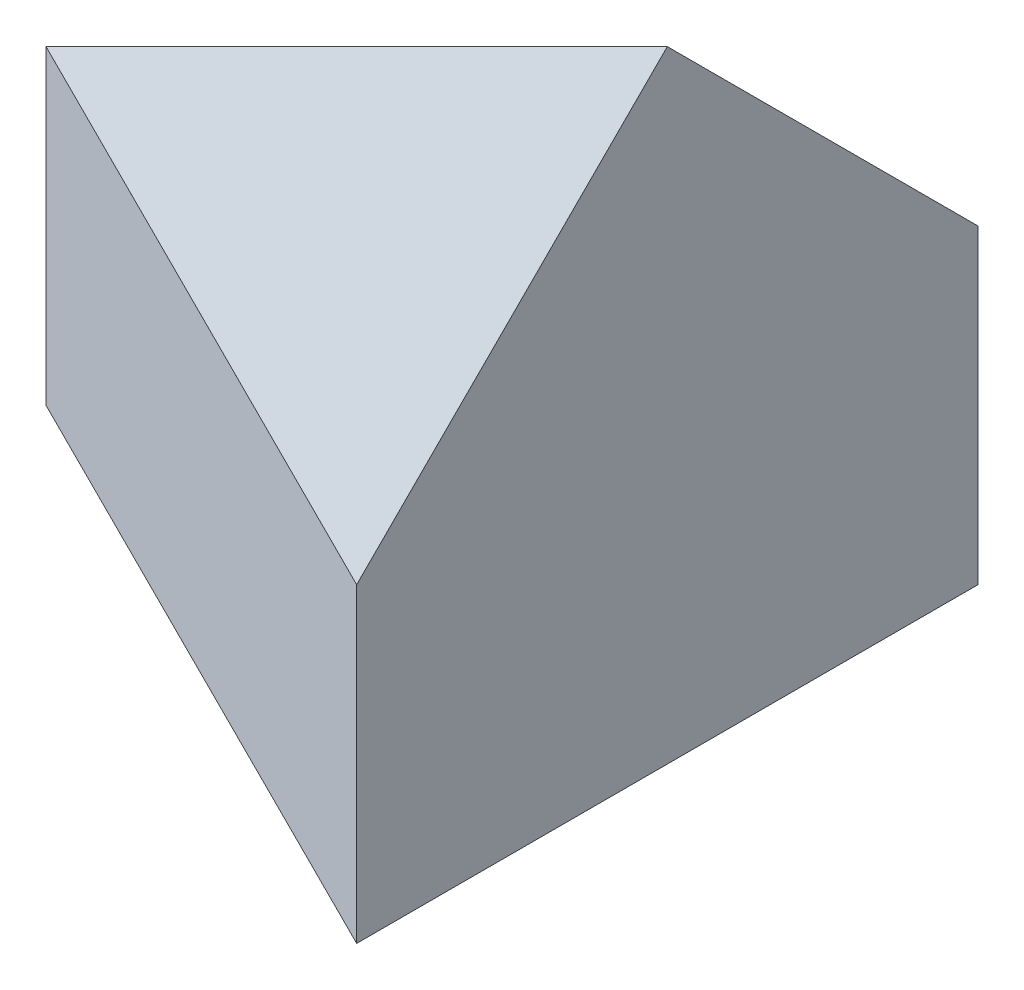
ISO-10303-21;
HEADER;
FILE_DESCRIPTION(('STEP AP214'),'2;1');
FILE_NAME('part.step','',(''),(''),'','','');
FILE_SCHEMA(('AUTOMOTIVE_DESIGN { 1 0 10303 214 1 1 1 1 }'));
ENDSEC;
DATA;
#1=APPLICATION_CONTEXT('core data for automotive mechanical design processes');
#2=APPLICATION_PROTOCOL_DEFINITION('international standard','automotive_design',2000,#1);
#3=PRODUCT_CONTEXT('',#1,'mechanical');
#4=PRODUCT('Part','Part','',(#3));
#5=PRODUCT_RELATED_PRODUCT_CATEGORY('part','',(#4));
#6=PRODUCT_DEFINITION_FORMATION('','',#4);
#7=PRODUCT_DEFINITION_CONTEXT('part definition',#1,'design');
#8=PRODUCT_DEFINITION('design','',#6,#7);
#9=PRODUCT_DEFINITION_SHAPE('','',#8);
#10=(LENGTH_UNIT() NAMED_UNIT(*) SI_UNIT(.MILLI.,.METRE.));
#11=(NAMED_UNIT(*) PLANE_ANGLE_UNIT() SI_UNIT($,.RADIAN.));
#12=(NAMED_UNIT(*) SI_UNIT($,.STERADIAN.) SOLID_ANGLE_UNIT());
#13=UNCERTAINTY_MEASURE_WITH_UNIT(LENGTH_MEASURE(1.E-05),#10,'distance_accuracy_value','');
#14=(GEOMETRIC_REPRESENTATION_CONTEXT(3) GLOBAL_UNCERTAINTY_ASSIGNED_CONTEXT((#13)) GLOBAL_UNIT_ASSIGNED_CONTEXT((#10,
#11,#12)) REPRESENTATION_CONTEXT('',''));
#15=CARTESIAN_POINT('',(0.,0.,0.));
#16=DIRECTION('',(0.,0.,1.));
#17=DIRECTION('',(1.,0.,0.));
#18=AXIS2_PLACEMENT_3D('',#15,#16,#17);
#19=CARTESIAN_POINT('',(40.,0.,40.));
#20=DIRECTION('',(-1.,0.,0.));
#21=DIRECTION('',(0.,0.,1.));
#22=AXIS2_PLACEMENT_3D('',#19,#20,#21);
#23=PLANE('',#22);
#24=DIRECTION('',(0.,-0.707090091795653,-0.707123470183542));
#25=VECTOR('',#24,1.);
#26=CARTESIAN_POINT('',(40.,30.0005499739353,10.0008661436681));
#27=LINE('',#26,#25);
#28=CARTESIAN_POINT('',(40.,40.,20.0007881966011));
#29=VERTEX_POINT('',#28);
#30=CARTESIAN_POINT('',(40.,20.0001559016994,0.));
#31=VERTEX_POINT('',#30);
#32=EDGE_CURVE('E63',#29,#31,#27,.T.);
#33=ORIENTED_EDGE('',*,*,#32,.F.);
#34=DIRECTION('',(0.,-1.,0.));
#35=VECTOR('',#34,1.);
#36=CARTESIAN_POINT('',(40.,0.,20.0007881966011));
#37=LINE('',#36,#35);
#38=CARTESIAN_POINT('',(40.,39.9998881966011,20.0007881966011));
#39=VERTEX_POINT('',#38);
#40=EDGE_CURVE('E228',#29,#39,#37,.T.);
#41=ORIENTED_EDGE('',*,*,#40,.T.);
#42=DIRECTION('',(0.,0.,1.));
#43=VECTOR('',#42,1.);
#44=CARTESIAN_POINT('',(40.,39.9998881966012,40.));
#45=LINE('',#44,#43);
#46=CARTESIAN_POINT('',(40.,39.9998881966011,20.0008881966011));
#47=VERTEX_POINT('',#46);
#48=EDGE_CURVE('E182',#39,#47,#45,.T.);
#49=ORIENTED_EDGE('',*,*,#48,.T.);
#50=DIRECTION('',(0.,1.,0.));
#51=VECTOR('',#50,1.);
#52=CARTESIAN_POINT('',(40.,0.,20.0008881966011));
#53=LINE('',#52,#51);
#54=CARTESIAN_POINT('',(40.,40.,20.0008881966011));
#55=VERTEX_POINT('',#54);
#56=EDGE_CURVE('E170',#47,#55,#53,.T.);
#57=ORIENTED_EDGE('',*,*,#56,.T.);
#58=DIRECTION('',(0.,0.707104804666945,-0.707108757700625));
#59=VECTOR('',#58,1.);
#60=CARTESIAN_POINT('',(40.,10.0005559071337,50.0004999998437));
#61=LINE('',#60,#59);
#62=CARTESIAN_POINT('',(40.,20.001,40.));
#63=VERTEX_POINT('',#62);
#64=EDGE_CURVE('E153',#63,#55,#61,.T.);
#65=ORIENTED_EDGE('',*,*,#64,.F.);
#66=DIRECTION('',(0.,0.,-1.));
#67=VECTOR('',#66,1.);
#68=CARTESIAN_POINT('',(40.,20.001,40.));
#69=LINE('',#68,#67);
#70=CARTESIAN_POINT('',(40.,20.001,39.9998881966011));
#71=VERTEX_POINT('',#70);
#72=EDGE_CURVE('E168',#63,#71,#69,.T.);
#73=ORIENTED_EDGE('',*,*,#72,.T.);
#74=DIRECTION('',(0.,-1.,0.));
#75=VECTOR('',#74,1.);
#76=CARTESIAN_POINT('',(40.,0.,39.9998881966011));
#77=LINE('',#76,#75);
#78=CARTESIAN_POINT('',(40.,20.,39.9998881966011));
#79=VERTEX_POINT('',#78);
#80=EDGE_CURVE('E178',#71,#79,#77,.T.);
#81=ORIENTED_EDGE('',*,*,#80,.T.);
#82=DIRECTION('',(0.,0.,1.));
#83=VECTOR('',#82,1.);
#84=CARTESIAN_POINT('',(40.,20.,40.));
#85=LINE('',#84,#83);
#86=CARTESIAN_POINT('',(40.,20.,40.));
#87=VERTEX_POINT('',#86);
#88=EDGE_CURVE('E180',#79,#87,#85,.T.);
#89=ORIENTED_EDGE('',*,*,#88,.T.);
#90=DIRECTION('',(0.,1.,0.));
#91=VECTOR('',#90,1.);
#92=CARTESIAN_POINT('',(40.,0.,40.));
#93=LINE('',#92,#91);
#94=CARTESIAN_POINT('',(40.,0.,40.));
#95=VERTEX_POINT('',#94);
#96=EDGE_CURVE('E240',#95,#87,#93,.T.);
#97=ORIENTED_EDGE('',*,*,#96,.F.);
#98=DIRECTION('',(0.,0.,-1.));
#99=VECTOR('',#98,1.);
#100=CARTESIAN_POINT('',(40.,0.,40.));
#101=LINE('',#100,#99);
#102=CARTESIAN_POINT('',(40.,0.,0.));
#103=VERTEX_POINT('',#102);
#104=EDGE_CURVE('E285',#95,#103,#101,.T.);
#105=ORIENTED_EDGE('',*,*,#104,.T.);
#106=DIRECTION('',(0.,1.,0.));
#107=VECTOR('',#106,1.);
#108=CARTESIAN_POINT('',(40.,0.,0.));
#109=LINE('',#108,#107);
#110=CARTESIAN_POINT('',(40.,20.0000559016994,0.));
#111=VERTEX_POINT('',#110);
#112=EDGE_CURVE('E57',#103,#111,#109,.T.);
#113=ORIENTED_EDGE('',*,*,#112,.T.);
#114=DIRECTION('',(0.,0.,1.));
#115=VECTOR('',#114,1.);
#116=CARTESIAN_POINT('',(40.,20.0000559016994,40.));
#117=LINE('',#116,#115);
#118=CARTESIAN_POINT('',(40.,20.0000559016994,0.000111803398882698));
#119=VERTEX_POINT('',#118);
#120=EDGE_CURVE('E216',#111,#119,#117,.T.);
#121=ORIENTED_EDGE('',*,*,#120,.T.);
#122=DIRECTION('',(0.,-1.,0.));
#123=VECTOR('',#122,1.);
#124=CARTESIAN_POINT('',(40.,0.,0.000111803398879229));
#125=LINE('',#124,#123);
#126=CARTESIAN_POINT('',(40.,20.0001559016994,0.000111803398882698));
#127=VERTEX_POINT('',#126);
#128=EDGE_CURVE('E265',#127,#119,#125,.T.);
#129=ORIENTED_EDGE('',*,*,#128,.F.);
#130=DIRECTION('',(0.,0.,-1.));
#131=VECTOR('',#130,1.);
#132=CARTESIAN_POINT('',(40.,20.0001559016994,40.));
#133=LINE('',#132,#131);
#134=EDGE_CURVE('E208',#127,#31,#133,.T.);
#135=ORIENTED_EDGE('',*,*,#134,.T.);
#136=EDGE_LOOP('',(#33,#41,#49,#57,#65,#73,#81,#89,#97,#105,#113,#121,#129,#135));
#137=FACE_BOUND('',#136,.T.);
#138=ADVANCED_FACE('F54',(#137),#23,.F.);
#139=CARTESIAN_POINT('',(-8.,16.,0.));
#140=DIRECTION('',(-0.447213595499958,0.894427190999916,0.));
#141=DIRECTION('',(-0.894427190999916,-0.447213595499958,0.));
#142=AXIS2_PLACEMENT_3D('',#139,#140,#141);
#143=PLANE('',#142);
#144=DIRECTION('',(1.68819382226999E-05,8.44096911134994E-06,0.999999999821875));
#145=VECTOR('',#144,1.);
#146=CARTESIAN_POINT('',(0.00166234507860061,20.0008311725393,-0.000168854461765728));
#147=LINE('',#146,#145);
#148=CARTESIAN_POINT('',(0.00199996981198325,20.000999984906,19.999000015094));
#149=VERTEX_POINT('',#148);
#150=CARTESIAN_POINT('',(0.00199999999998292,20.001,20.0007881966011));
#151=VERTEX_POINT('',#150);
#152=EDGE_CURVE('E13',#149,#151,#147,.T.);
#153=ORIENTED_EDGE('',*,*,#152,.F.);
#154=DIRECTION('',(-0.816496580927726,-0.408248290463863,0.408248290463863));
#155=VECTOR('',#154,1.);
#156=CARTESIAN_POINT('',(40.,40.,0.));
#157=LINE('',#156,#155);
#158=CARTESIAN_POINT('',(0.000311803398837275,20.0001559016994,19.9998440983006));
#159=VERTEX_POINT('',#158);
#160=EDGE_CURVE('E207',#149,#159,#157,.T.);
#161=ORIENTED_EDGE('',*,*,#160,.T.);
#162=DIRECTION('',(0.,0.,-1.));
#163=VECTOR('',#162,1.);
#164=CARTESIAN_POINT('',(0.000311803398832938,20.0001559016994,0.));
#165=LINE('',#164,#163);
#166=CARTESIAN_POINT('',(0.000311803398836761,20.0001559016994,19.9999559016995));
#167=VERTEX_POINT('',#166);
#168=EDGE_CURVE('E294',#167,#159,#165,.T.);
#169=ORIENTED_EDGE('',*,*,#168,.F.);
#170=DIRECTION('',(-0.816496580927726,-0.408248290463863,0.408248290463863));
#171=VECTOR('',#170,1.);
#172=CARTESIAN_POINT('',(3.72677996258314E-05,20.0000186338998,20.0000931694991));
#173=LINE('',#172,#171);
#174=CARTESIAN_POINT('',(0.000223606797750651,20.0001118033989,20.));
#175=VERTEX_POINT('',#174);
#176=EDGE_CURVE('E203',#167,#175,#173,.T.);
#177=ORIENTED_EDGE('',*,*,#176,.T.);
#178=DIRECTION('',(-0.816496580927726,-0.408248290463863,-0.408248290463863));
#179=VECTOR('',#178,1.);
#180=CARTESIAN_POINT('',(-13.3332960655337,13.3333519672332,13.3332401638343));
#181=LINE('',#180,#179);
#182=CARTESIAN_POINT('',(0.00199999999998812,20.001,20.0008881966011));
#183=VERTEX_POINT('',#182);
#184=EDGE_CURVE('E275',#183,#175,#181,.T.);
#185=ORIENTED_EDGE('',*,*,#184,.F.);
#186=DIRECTION('',(0.,0.,1.));
#187=VECTOR('',#186,1.);
#188=CARTESIAN_POINT('',(0.00199999999998292,20.001,20.0008881966011));
#189=LINE('',#188,#187);
#190=EDGE_CURVE('E193',#151,#183,#189,.T.);
#191=ORIENTED_EDGE('',*,*,#190,.F.);
#192=EDGE_LOOP('',(#153,#161,#169,#177,#185,#191));
#193=FACE_BOUND('',#192,.T.);
#194=ADVANCED_FACE('F308',(#193),#143,.T.);
#195=CARTESIAN_POINT('',(8.,40.,16.));
#196=DIRECTION('',(0.447213595499958,0.,0.894427190999916));
#197=DIRECTION('',(0.894427190999916,0.,-0.447213595499958));
#198=AXIS2_PLACEMENT_3D('',#195,#196,#197);
#199=PLANE('',#198);
#200=ORIENTED_EDGE('',*,*,#160,.F.);
#201=DIRECTION('',(0.894427190840585,-1.88752180294838E-05,-0.447213595420293));
#202=VECTOR('',#201,1.);
#203=CARTESIAN_POINT('',(7.999662363868,20.0008312091544,16.000168818066));
#204=LINE('',#203,#202);
#205=EDGE_CURVE('E70',#149,#31,#204,.T.);
#206=ORIENTED_EDGE('',*,*,#205,.T.);
#207=DIRECTION('',(0.894427190999916,0.,-0.447213595499958));
#208=VECTOR('',#207,1.);
#209=CARTESIAN_POINT('',(0.000111803398858412,20.0001559016994,19.9999440983006));
#210=LINE('',#209,#208);
#211=EDGE_CURVE('E267',#159,#31,#210,.T.);
#212=ORIENTED_EDGE('',*,*,#211,.F.);
#213=EDGE_LOOP('',(#200,#206,#212));
#214=FACE_BOUND('',#213,.T.);
#215=ADVANCED_FACE('F348',(#214),#199,.F.);
#216=DIRECTION('',(0.,1.,0.));
#217=VECTOR('',#216,1.);
#218=CARTESIAN_POINT('',(0.000111803398867086,40.,19.9999440983006));
#219=LINE('',#218,#217);
#220=CARTESIAN_POINT('',(0.000111803398867857,20.,19.9999440983006));
#221=VERTEX_POINT('',#220);
#222=CARTESIAN_POINT('',(0.000111803398858412,20.0000559016994,19.9999440983006));
#223=VERTEX_POINT('',#222);
#224=EDGE_CURVE('E202',#221,#223,#219,.T.);
#225=ORIENTED_EDGE('',*,*,#224,.T.);
#226=DIRECTION('',(-0.894427190999916,0.,0.447213595499958));
#227=VECTOR('',#226,1.);
#228=CARTESIAN_POINT('',(0.000111803398858412,20.0000559016994,19.9999440983006));
#229=LINE('',#228,#227);
#230=EDGE_CURVE('E266',#111,#223,#229,.T.);
#231=ORIENTED_EDGE('',*,*,#230,.F.);
#232=ORIENTED_EDGE('',*,*,#112,.F.);
#233=DIRECTION('',(-0.894427190999916,0.,0.447213595499958));
#234=VECTOR('',#233,1.);
#235=CARTESIAN_POINT('',(8.,0.,16.));
#236=LINE('',#235,#234);
#237=CARTESIAN_POINT('',(0.,0.,20.));
#238=VERTEX_POINT('',#237);
#239=EDGE_CURVE('E279',#103,#238,#236,.T.);
#240=ORIENTED_EDGE('',*,*,#239,.T.);
#241=DIRECTION('',(0.,-1.,0.));
#242=VECTOR('',#241,1.);
#243=CARTESIAN_POINT('',(0.,40.,20.));
#244=LINE('',#243,#242);
#245=CARTESIAN_POINT('',(0.,20.,20.));
#246=VERTEX_POINT('',#245);
#247=EDGE_CURVE('E243',#246,#238,#244,.T.);
#248=ORIENTED_EDGE('',*,*,#247,.F.);
#249=DIRECTION('',(0.894427190999916,0.,-0.447213595499958));
#250=VECTOR('',#249,1.);
#251=CARTESIAN_POINT('',(8.,20.,16.));
#252=LINE('',#251,#250);
#253=EDGE_CURVE('E244',#246,#221,#252,.T.);
#254=ORIENTED_EDGE('',*,*,#253,.T.);
#255=EDGE_LOOP('',(#225,#231,#232,#240,#248,#254));
#256=FACE_BOUND('',#255,.T.);
#257=ADVANCED_FACE('F327',(#256),#199,.F.);
#258=CARTESIAN_POINT('',(-8.,40.,16.));
#259=DIRECTION('',(0.447213595499958,0.,-0.894427190999916));
#260=DIRECTION('',(-0.894427190999916,0.,-0.447213595499958));
#261=AXIS2_PLACEMENT_3D('',#258,#259,#260);
#262=PLANE('',#261);
#263=ORIENTED_EDGE('',*,*,#96,.T.);
#264=DIRECTION('',(0.894427190999916,0.,0.447213595499958));
#265=VECTOR('',#264,1.);
#266=CARTESIAN_POINT('',(0.,20.,20.));
#267=LINE('',#266,#265);
#268=EDGE_CURVE('E276',#246,#87,#267,.T.);
#269=ORIENTED_EDGE('',*,*,#268,.F.);
#270=ORIENTED_EDGE('',*,*,#247,.T.);
#271=DIRECTION('',(0.894427190999916,0.,0.447213595499958));
#272=VECTOR('',#271,1.);
#273=CARTESIAN_POINT('',(-8.,0.,16.));
#274=LINE('',#273,#272);
#275=EDGE_CURVE('E162',#238,#95,#274,.T.);
#276=ORIENTED_EDGE('',*,*,#275,.T.);
#277=EDGE_LOOP('',(#263,#269,#270,#276));
#278=FACE_BOUND('',#277,.T.);
#279=ADVANCED_FACE('F317',(#278),#262,.F.);
#280=CARTESIAN_POINT('',(0.,0.,40.));
#281=DIRECTION('',(0.,1.,0.));
#282=DIRECTION('',(0.,0.,1.));
#283=AXIS2_PLACEMENT_3D('',#280,#281,#282);
#284=PLANE('',#283);
#285=ORIENTED_EDGE('',*,*,#104,.F.);
#286=ORIENTED_EDGE('',*,*,#275,.F.);
#287=ORIENTED_EDGE('',*,*,#239,.F.);
#288=EDGE_LOOP('',(#285,#286,#287));
#289=FACE_BOUND('',#288,.T.);
#290=ADVANCED_FACE('F323',(#289),#284,.F.);
#291=DIRECTION('',(-0.894427190997121,-0.44721359549856,2.5001250058718E-06));
#292=VECTOR('',#291,1.);
#293=CARTESIAN_POINT('',(40.,40.,20.0008881966011));
#294=LINE('',#293,#292);
#295=CARTESIAN_POINT('',(0.00199999999995636,20.001,20.001));
#296=VERTEX_POINT('',#295);
#297=EDGE_CURVE('E156',#55,#296,#294,.T.);
#298=ORIENTED_EDGE('',*,*,#297,.F.);
#299=DIRECTION('',(0.894427190999916,0.447213595499958,0.));
#300=VECTOR('',#299,1.);
#301=CARTESIAN_POINT('',(0.00199999999998292,20.001,20.0008881966011));
#302=LINE('',#301,#300);
#303=EDGE_CURVE('E191',#183,#55,#302,.T.);
#304=ORIENTED_EDGE('',*,*,#303,.F.);
#305=DIRECTION('',(0.,0.,-1.));
#306=VECTOR('',#305,1.);
#307=CARTESIAN_POINT('',(0.00199999999998465,20.001,0.));
#308=LINE('',#307,#306);
#309=EDGE_CURVE('E161',#296,#183,#308,.T.);
#310=ORIENTED_EDGE('',*,*,#309,.F.);
#311=EDGE_LOOP('',(#298,#304,#310));
#312=FACE_BOUND('',#311,.T.);
#313=ADVANCED_FACE('F341',(#312),#143,.T.);
#314=CARTESIAN_POINT('',(4.47213595447916E-05,20.001,19.9999105572809));
#315=DIRECTION('',(0.,1.,0.));
#316=DIRECTION('',(0.,0.,1.));
#317=AXIS2_PLACEMENT_3D('',#314,#315,#316);
#318=PLANE('',#317);
#319=DIRECTION('',(-0.894427190999916,0.,-0.447213595499958));
#320=VECTOR('',#319,1.);
#321=CARTESIAN_POINT('',(0.,20.001,20.));
#322=LINE('',#321,#320);
#323=EDGE_CURVE('E150',#63,#296,#322,.T.);
#324=ORIENTED_EDGE('',*,*,#323,.T.);
#325=ORIENTED_EDGE('',*,*,#309,.T.);
#326=DIRECTION('',(-0.894427190999916,0.,-0.447213595499958));
#327=VECTOR('',#326,1.);
#328=CARTESIAN_POINT('',(4.47213595447916E-05,20.001,19.9999105572809));
#329=LINE('',#328,#327);
#330=EDGE_CURVE('E177',#71,#183,#329,.T.);
#331=ORIENTED_EDGE('',*,*,#330,.F.);
#332=ORIENTED_EDGE('',*,*,#72,.F.);
#333=EDGE_LOOP('',(#324,#325,#331,#332));
#334=FACE_BOUND('',#333,.T.);
#335=ADVANCED_FACE('F175',(#334),#318,.F.);
#336=CARTESIAN_POINT('',(4.47213595447916E-05,20.,19.9999105572809));
#337=DIRECTION('',(0.,-1.,0.));
#338=DIRECTION('',(0.,0.,-1.));
#339=AXIS2_PLACEMENT_3D('',#336,#337,#338);
#340=PLANE('',#339);
#341=DIRECTION('',(0.894427190999916,0.,0.447213595499958));
#342=VECTOR('',#341,1.);
#343=CARTESIAN_POINT('',(4.47213595447916E-05,20.,19.9999105572809));
#344=LINE('',#343,#342);
#345=EDGE_CURVE('E270',#221,#79,#344,.T.);
#346=ORIENTED_EDGE('',*,*,#345,.F.);
#347=ORIENTED_EDGE('',*,*,#253,.F.);
#348=ORIENTED_EDGE('',*,*,#268,.T.);
#349=ORIENTED_EDGE('',*,*,#88,.F.);
#350=EDGE_LOOP('',(#346,#347,#348,#349));
#351=FACE_BOUND('',#350,.T.);
#352=ADVANCED_FACE('F332',(#351),#340,.F.);
#353=CARTESIAN_POINT('',(-7.99995527864045,0.,15.9999105572809));
#354=DIRECTION('',(0.447213595499958,0.,-0.894427190999916));
#355=DIRECTION('',(-0.894427190999916,0.,-0.447213595499958));
#356=AXIS2_PLACEMENT_3D('',#353,#354,#355);
#357=PLANE('',#356);
#358=DIRECTION('',(0.,1.,0.));
#359=VECTOR('',#358,1.);
#360=CARTESIAN_POINT('',(0.000223606797751519,0.,20.));
#361=LINE('',#360,#359);
#362=CARTESIAN_POINT('',(0.000223606797751519,20.0000559016994,20.));
#363=VERTEX_POINT('',#362);
#364=EDGE_CURVE('E262',#363,#175,#361,.T.);
#365=ORIENTED_EDGE('',*,*,#364,.F.);
#366=DIRECTION('',(-0.894427190999916,0.,-0.447213595499958));
#367=VECTOR('',#366,1.);
#368=CARTESIAN_POINT('',(-7.99995527864045,20.0000559016994,15.9999105572809));
#369=LINE('',#368,#367);
#370=EDGE_CURVE('E273',#363,#223,#369,.T.);
#371=ORIENTED_EDGE('',*,*,#370,.T.);
#372=ORIENTED_EDGE('',*,*,#224,.F.);
#373=ORIENTED_EDGE('',*,*,#345,.T.);
#374=ORIENTED_EDGE('',*,*,#80,.F.);
#375=ORIENTED_EDGE('',*,*,#330,.T.);
#376=ORIENTED_EDGE('',*,*,#184,.T.);
#377=EDGE_LOOP('',(#365,#371,#372,#373,#374,#375,#376));
#378=FACE_BOUND('',#377,.T.);
#379=ADVANCED_FACE('F311',(#378),#357,.F.);
#380=CARTESIAN_POINT('',(0.000156524758408408,20.0001559016994,20.0000335410197));
#381=DIRECTION('',(0.,1.,0.));
#382=DIRECTION('',(-1.,0.,0.));
#383=AXIS2_PLACEMENT_3D('',#380,#381,#382);
#384=PLANE('',#383);
#385=DIRECTION('',(0.894427190999916,0.,-0.447213595499958));
#386=VECTOR('',#385,1.);
#387=CARTESIAN_POINT('',(0.000156524758408408,20.0001559016994,20.0000335410197));
#388=LINE('',#387,#386);
#389=EDGE_CURVE('E257',#167,#127,#388,.T.);
#390=ORIENTED_EDGE('',*,*,#389,.F.);
#391=ORIENTED_EDGE('',*,*,#168,.T.);
#392=ORIENTED_EDGE('',*,*,#211,.T.);
#393=ORIENTED_EDGE('',*,*,#134,.F.);
#394=EDGE_LOOP('',(#390,#391,#392,#393));
#395=FACE_BOUND('',#394,.T.);
#396=ADVANCED_FACE('F339',(#395),#384,.F.);
#397=CARTESIAN_POINT('',(0.000156524758408408,20.0000559016994,20.0000335410197));
#398=DIRECTION('',(0.,-1.,0.));
#399=DIRECTION('',(0.,0.,-1.));
#400=AXIS2_PLACEMENT_3D('',#397,#398,#399);
#401=PLANE('',#400);
#402=ORIENTED_EDGE('',*,*,#230,.T.);
#403=ORIENTED_EDGE('',*,*,#370,.F.);
#404=DIRECTION('',(-0.894427190999916,0.,0.447213595499958));
#405=VECTOR('',#404,1.);
#406=CARTESIAN_POINT('',(0.000156524758408408,20.0000559016994,20.0000335410197));
#407=LINE('',#406,#405);
#408=EDGE_CURVE('E263',#119,#363,#407,.T.);
#409=ORIENTED_EDGE('',*,*,#408,.F.);
#410=ORIENTED_EDGE('',*,*,#120,.F.);
#411=EDGE_LOOP('',(#402,#403,#409,#410));
#412=FACE_BOUND('',#411,.T.);
#413=ADVANCED_FACE('F330',(#412),#401,.F.);
#414=CARTESIAN_POINT('',(8.00004472135955,0.,16.0000894427191));
#415=DIRECTION('',(-0.447213595499958,0.,-0.894427190999916));
#416=DIRECTION('',(-0.894427190999916,0.,0.447213595499958));
#417=AXIS2_PLACEMENT_3D('',#414,#415,#416);
#418=PLANE('',#417);
#419=ORIENTED_EDGE('',*,*,#128,.T.);
#420=ORIENTED_EDGE('',*,*,#408,.T.);
#421=ORIENTED_EDGE('',*,*,#364,.T.);
#422=ORIENTED_EDGE('',*,*,#176,.F.);
#423=ORIENTED_EDGE('',*,*,#389,.T.);
#424=EDGE_LOOP('',(#419,#420,#421,#422,#423));
#425=FACE_BOUND('',#424,.T.);
#426=ADVANCED_FACE('F381',(#425),#418,.T.);
#427=CARTESIAN_POINT('',(-7.99995527864046,15.9999105572809,0.));
#428=DIRECTION('',(0.447213595499958,-0.894427190999916,0.));
#429=DIRECTION('',(0.894427190999916,0.447213595499958,0.));
#430=AXIS2_PLACEMENT_3D('',#427,#428,#429);
#431=PLANE('',#430);
#432=DIRECTION('',(-0.894427190999916,-0.447213595499958,0.));
#433=VECTOR('',#432,1.);
#434=CARTESIAN_POINT('',(0.00204472135953291,20.0009105572809,20.0007881966011));
#435=LINE('',#434,#433);
#436=CARTESIAN_POINT('',(0.00204472135953291,20.0009105572809,20.0007881966011));
#437=VERTEX_POINT('',#436);
#438=EDGE_CURVE('E252',#39,#437,#435,.T.);
#439=ORIENTED_EDGE('',*,*,#438,.T.);
#440=DIRECTION('',(0.,0.,1.));
#441=VECTOR('',#440,1.);
#442=CARTESIAN_POINT('',(0.00204472135953291,20.0009105572809,20.0008881966011));
#443=LINE('',#442,#441);
#444=CARTESIAN_POINT('',(0.00204472135953291,20.0009105572809,20.0008881966011));
#445=VERTEX_POINT('',#444);
#446=EDGE_CURVE('E248',#437,#445,#443,.T.);
#447=ORIENTED_EDGE('',*,*,#446,.T.);
#448=DIRECTION('',(0.894427190999916,0.447213595499958,0.));
#449=VECTOR('',#448,1.);
#450=CARTESIAN_POINT('',(0.00204472135953291,20.0009105572809,20.0008881966011));
#451=LINE('',#450,#449);
#452=EDGE_CURVE('E251',#445,#47,#451,.T.);
#453=ORIENTED_EDGE('',*,*,#452,.T.);
#454=ORIENTED_EDGE('',*,*,#48,.F.);
#455=EDGE_LOOP('',(#439,#447,#453,#454));
#456=FACE_BOUND('',#455,.T.);
#457=ADVANCED_FACE('F379',(#456),#431,.F.);
#458=CARTESIAN_POINT('',(0.00204472135953291,20.0009105572809,20.0007881966011));
#459=DIRECTION('',(0.,0.,-1.));
#460=DIRECTION('',(-1.,0.,0.));
#461=AXIS2_PLACEMENT_3D('',#458,#459,#460);
#462=PLANE('',#461);
#463=DIRECTION('',(-0.894427190999916,-0.447213595499958,0.));
#464=VECTOR('',#463,1.);
#465=CARTESIAN_POINT('',(0.00199999999998292,20.001,20.0007881966011));
#466=LINE('',#465,#464);
#467=EDGE_CURVE('E255',#29,#151,#466,.T.);
#468=ORIENTED_EDGE('',*,*,#467,.T.);
#469=DIRECTION('',(-0.447213595499958,0.894427190999916,0.));
#470=VECTOR('',#469,1.);
#471=CARTESIAN_POINT('',(0.00204472135953291,20.0009105572809,20.0007881966011));
#472=LINE('',#471,#470);
#473=EDGE_CURVE('E172',#437,#151,#472,.T.);
#474=ORIENTED_EDGE('',*,*,#473,.F.);
#475=ORIENTED_EDGE('',*,*,#438,.F.);
#476=ORIENTED_EDGE('',*,*,#40,.F.);
#477=EDGE_LOOP('',(#468,#474,#475,#476));
#478=FACE_BOUND('',#477,.T.);
#479=ADVANCED_FACE('F374',(#478),#462,.F.);
#480=CARTESIAN_POINT('',(0.00204472135953291,20.0009105572809,20.0008881966011));
#481=DIRECTION('',(0.,0.,1.));
#482=DIRECTION('',(1.,0.,0.));
#483=AXIS2_PLACEMENT_3D('',#480,#481,#482);
#484=PLANE('',#483);
#485=ORIENTED_EDGE('',*,*,#452,.F.);
#486=DIRECTION('',(-0.447213595499958,0.894427190999916,0.));
#487=VECTOR('',#486,1.);
#488=CARTESIAN_POINT('',(0.00204472135953291,20.0009105572809,20.0008881966011));
#489=LINE('',#488,#487);
#490=EDGE_CURVE('E194',#445,#183,#489,.T.);
#491=ORIENTED_EDGE('',*,*,#490,.T.);
#492=ORIENTED_EDGE('',*,*,#303,.T.);
#493=ORIENTED_EDGE('',*,*,#56,.F.);
#494=EDGE_LOOP('',(#485,#491,#492,#493));
#495=FACE_BOUND('',#494,.T.);
#496=ADVANCED_FACE('F360',(#495),#484,.F.);
#497=CARTESIAN_POINT('',(0.00204472135953291,20.0009105572809,20.0008881966011));
#498=DIRECTION('',(-0.894427190999916,-0.447213595499958,0.));
#499=DIRECTION('',(0.447213595499958,-0.894427190999916,0.));
#500=AXIS2_PLACEMENT_3D('',#497,#498,#499);
#501=PLANE('',#500);
#502=ORIENTED_EDGE('',*,*,#190,.T.);
#503=ORIENTED_EDGE('',*,*,#490,.F.);
#504=ORIENTED_EDGE('',*,*,#446,.F.);
#505=ORIENTED_EDGE('',*,*,#473,.T.);
#506=EDGE_LOOP('',(#502,#503,#504,#505));
#507=FACE_BOUND('',#506,.T.);
#508=ADVANCED_FACE('F363',(#507),#501,.F.);
#509=CARTESIAN_POINT('',(-8.88909178621121,17.7782829604592,17.7781835724224));
#510=DIRECTION('',(-0.33333250511937,0.666668737195788,0.66666501023874));
#511=DIRECTION('',(0.,-0.707104804666947,0.707108757700623));
#512=AXIS2_PLACEMENT_3D('',#509,#510,#511);
#513=PLANE('',#512);
#514=ORIENTED_EDGE('',*,*,#64,.T.);
#515=ORIENTED_EDGE('',*,*,#297,.T.);
#516=ORIENTED_EDGE('',*,*,#323,.F.);
#517=EDGE_LOOP('',(#514,#515,#516));
#518=FACE_BOUND('',#517,.T.);
#519=ADVANCED_FACE('F152',(#518),#513,.T.);
#520=CARTESIAN_POINT('',(-3.46462757627556E-05,6.92925515255112E-05,-6.9289280705407E-05));
#521=DIRECTION('',(-0.333340326433496,0.666680652866992,-0.666649183503626));
#522=DIRECTION('',(0.,0.707090091795654,0.707123470183541));
#523=AXIS2_PLACEMENT_3D('',#520,#521,#522);
#524=PLANE('',#523);
#525=DIRECTION('',(-0.894411195638204,1.88752180174117E-05,0.447245584394932));
#526=VECTOR('',#525,1.);
#527=CARTESIAN_POINT('',(40.,20.0001559016994,0.));
#528=LINE('',#527,#526);
#529=EDGE_CURVE('E206',#31,#151,#528,.T.);
#530=ORIENTED_EDGE('',*,*,#529,.T.);
#531=ORIENTED_EDGE('',*,*,#467,.F.);
#532=ORIENTED_EDGE('',*,*,#32,.T.);
#533=EDGE_LOOP('',(#530,#531,#532));
#534=FACE_BOUND('',#533,.T.);
#535=ADVANCED_FACE('F377',(#534),#524,.T.);
#536=CARTESIAN_POINT('',(40.,20.0001559016994,0.));
#537=DIRECTION('',(-1.68825082416221E-05,-0.999999999821863,8.44125412081107E-06));
#538=DIRECTION('',(0.99999999985749,-1.68825082422236E-05,0.));
#539=AXIS2_PLACEMENT_3D('',#536,#537,#538);
#540=PLANE('',#539);
#541=ORIENTED_EDGE('',*,*,#152,.T.);
#542=ORIENTED_EDGE('',*,*,#529,.F.);
#543=ORIENTED_EDGE('',*,*,#205,.F.);
#544=EDGE_LOOP('',(#541,#542,#543));
#545=FACE_BOUND('',#544,.T.);
#546=ADVANCED_FACE('F455',(#545),#540,.F.);
#547=CLOSED_SHELL('',(#138,#194,#215,#257,#279,#290,#313,#335,#352,#379,#396,#413,#426,#457,
#479,#496,#508,#519,#535,#546));
#548=MANIFOLD_SOLID_BREP('B2',#547);
#549=ADVANCED_BREP_SHAPE_REPRESENTATION('',(#18,#548),#14);
#550=SHAPE_DEFINITION_REPRESENTATION(#9,#549);
ENDSEC;
END-ISO-10303-21;
